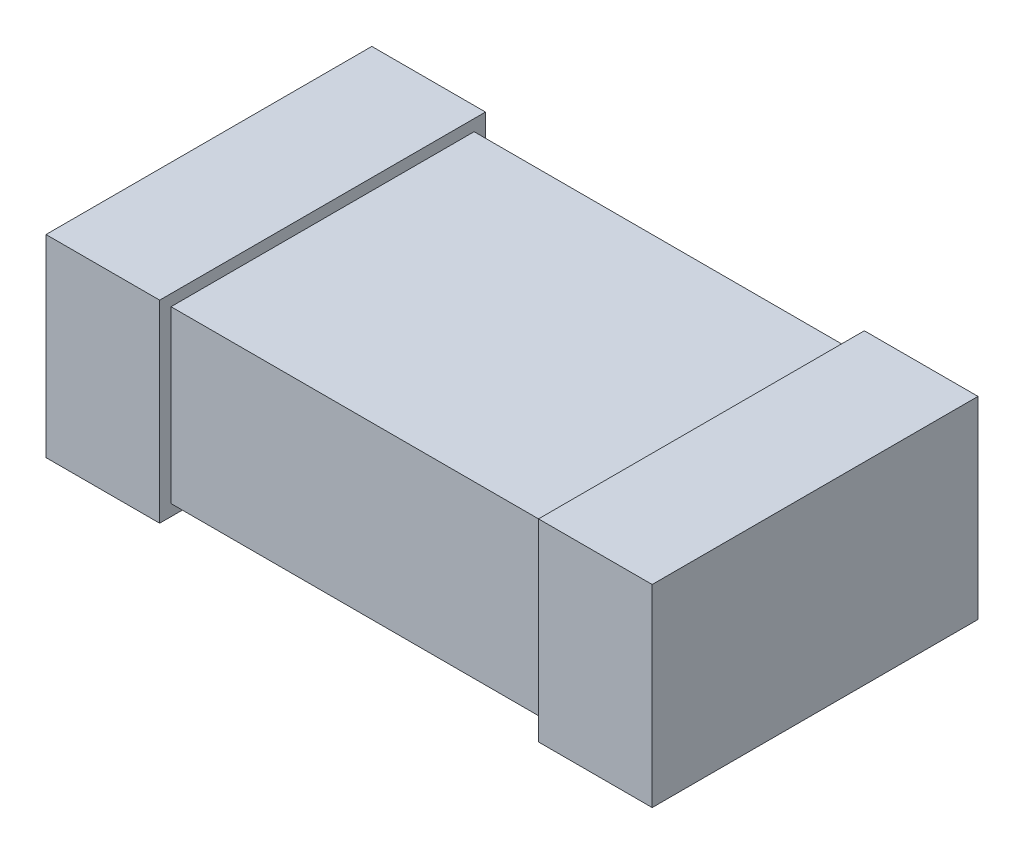
ISO-10303-21;
HEADER;
FILE_DESCRIPTION(('STEP AP214'),'2;1');
FILE_NAME('part.step','',(''),(''),'','','');
FILE_SCHEMA(('AUTOMOTIVE_DESIGN { 1 0 10303 214 1 1 1 1 }'));
ENDSEC;
DATA;
#1=APPLICATION_CONTEXT('core data for automotive mechanical design processes');
#2=APPLICATION_PROTOCOL_DEFINITION('international standard','automotive_design',2000,#1);
#3=PRODUCT_CONTEXT('',#1,'mechanical');
#4=PRODUCT('Part','Part','',(#3));
#5=PRODUCT_RELATED_PRODUCT_CATEGORY('part','',(#4));
#6=PRODUCT_DEFINITION_FORMATION('','',#4);
#7=PRODUCT_DEFINITION_CONTEXT('part definition',#1,'design');
#8=PRODUCT_DEFINITION('design','',#6,#7);
#9=PRODUCT_DEFINITION_SHAPE('','',#8);
#10=(LENGTH_UNIT() NAMED_UNIT(*) SI_UNIT(.MILLI.,.METRE.));
#11=(NAMED_UNIT(*) PLANE_ANGLE_UNIT() SI_UNIT($,.RADIAN.));
#12=(NAMED_UNIT(*) SI_UNIT($,.STERADIAN.) SOLID_ANGLE_UNIT());
#13=UNCERTAINTY_MEASURE_WITH_UNIT(LENGTH_MEASURE(1.E-05),#10,'distance_accuracy_value','');
#14=(GEOMETRIC_REPRESENTATION_CONTEXT(3) GLOBAL_UNCERTAINTY_ASSIGNED_CONTEXT((#13)) GLOBAL_UNIT_ASSIGNED_CONTEXT((#10,
#11,#12)) REPRESENTATION_CONTEXT('',''));
#15=CARTESIAN_POINT('',(0.,0.,0.));
#16=DIRECTION('',(0.,0.,1.));
#17=DIRECTION('',(1.,0.,0.));
#18=AXIS2_PLACEMENT_3D('',#15,#16,#17);
#19=CARTESIAN_POINT('',(-0.8,0.45,0.4));
#20=DIRECTION('',(0.,0.,-1.));
#21=DIRECTION('',(-1.,0.,0.));
#22=AXIS2_PLACEMENT_3D('',#19,#20,#21);
#23=PLANE('',#22);
#24=DIRECTION('',(0.,-1.,0.));
#25=VECTOR('',#24,1.);
#26=CARTESIAN_POINT('',(0.5,0.450000000000001,0.4));
#27=LINE('',#26,#25);
#28=CARTESIAN_POINT('',(0.5,0.45,0.4));
#29=VERTEX_POINT('',#28);
#30=CARTESIAN_POINT('',(0.5,0.,0.4));
#31=VERTEX_POINT('',#30);
#32=EDGE_CURVE('E51',#29,#31,#27,.T.);
#33=ORIENTED_EDGE('',*,*,#32,.F.);
#34=DIRECTION('',(1.,0.,0.));
#35=VECTOR('',#34,1.);
#36=CARTESIAN_POINT('',(-0.8,0.45,0.4));
#37=LINE('',#36,#35);
#38=CARTESIAN_POINT('',(-0.5,0.45,0.4));
#39=VERTEX_POINT('',#38);
#40=EDGE_CURVE('E216',#39,#29,#37,.T.);
#41=ORIENTED_EDGE('',*,*,#40,.F.);
#42=DIRECTION('',(0.,1.,0.));
#43=VECTOR('',#42,1.);
#44=CARTESIAN_POINT('',(-0.5,0.45,0.4));
#45=LINE('',#44,#43);
#46=CARTESIAN_POINT('',(-0.5,0.,0.4));
#47=VERTEX_POINT('',#46);
#48=EDGE_CURVE('E210',#47,#39,#45,.T.);
#49=ORIENTED_EDGE('',*,*,#48,.F.);
#50=DIRECTION('',(1.,0.,0.));
#51=VECTOR('',#50,1.);
#52=CARTESIAN_POINT('',(-0.8,0.,0.4));
#53=LINE('',#52,#51);
#54=EDGE_CURVE('E215',#47,#31,#53,.T.);
#55=ORIENTED_EDGE('',*,*,#54,.T.);
#56=EDGE_LOOP('',(#33,#41,#49,#55));
#57=FACE_BOUND('',#56,.T.);
#58=ADVANCED_FACE('F36',(#57),#23,.F.);
#59=CARTESIAN_POINT('',(-0.8,0.45,-0.4));
#60=DIRECTION('',(0.,0.,1.));
#61=DIRECTION('',(1.,0.,0.));
#62=AXIS2_PLACEMENT_3D('',#59,#60,#61);
#63=PLANE('',#62);
#64=DIRECTION('',(0.,1.,0.));
#65=VECTOR('',#64,1.);
#66=CARTESIAN_POINT('',(0.5,0.450000000000001,-0.4));
#67=LINE('',#66,#65);
#68=CARTESIAN_POINT('',(0.5,0.,-0.4));
#69=VERTEX_POINT('',#68);
#70=CARTESIAN_POINT('',(0.5,0.45,-0.4));
#71=VERTEX_POINT('',#70);
#72=EDGE_CURVE('E165',#69,#71,#67,.T.);
#73=ORIENTED_EDGE('',*,*,#72,.F.);
#74=DIRECTION('',(-1.,0.,0.));
#75=VECTOR('',#74,1.);
#76=CARTESIAN_POINT('',(-0.8,0.,-0.4));
#77=LINE('',#76,#75);
#78=CARTESIAN_POINT('',(-0.5,0.,-0.4));
#79=VERTEX_POINT('',#78);
#80=EDGE_CURVE('E219',#69,#79,#77,.T.);
#81=ORIENTED_EDGE('',*,*,#80,.T.);
#82=DIRECTION('',(0.,-1.,0.));
#83=VECTOR('',#82,1.);
#84=CARTESIAN_POINT('',(-0.5,0.45,-0.4));
#85=LINE('',#84,#83);
#86=CARTESIAN_POINT('',(-0.5,0.45,-0.4));
#87=VERTEX_POINT('',#86);
#88=EDGE_CURVE('E198',#87,#79,#85,.T.);
#89=ORIENTED_EDGE('',*,*,#88,.F.);
#90=DIRECTION('',(-1.,0.,0.));
#91=VECTOR('',#90,1.);
#92=CARTESIAN_POINT('',(-0.8,0.45,-0.4));
#93=LINE('',#92,#91);
#94=EDGE_CURVE('E218',#71,#87,#93,.T.);
#95=ORIENTED_EDGE('',*,*,#94,.F.);
#96=EDGE_LOOP('',(#73,#81,#89,#95));
#97=FACE_BOUND('',#96,.T.);
#98=ADVANCED_FACE('F236',(#97),#63,.F.);
#99=CARTESIAN_POINT('',(-0.8,0.45,0.4));
#100=DIRECTION('',(0.,1.,0.));
#101=DIRECTION('',(0.,0.,1.));
#102=AXIS2_PLACEMENT_3D('',#99,#100,#101);
#103=PLANE('',#102);
#104=ORIENTED_EDGE('',*,*,#40,.T.);
#105=DIRECTION('',(0.,0.,-1.));
#106=VECTOR('',#105,1.);
#107=CARTESIAN_POINT('',(0.5,0.45,0.4));
#108=LINE('',#107,#106);
#109=EDGE_CURVE('E58',#29,#71,#108,.T.);
#110=ORIENTED_EDGE('',*,*,#109,.T.);
#111=ORIENTED_EDGE('',*,*,#94,.T.);
#112=DIRECTION('',(0.,0.,1.));
#113=VECTOR('',#112,1.);
#114=CARTESIAN_POINT('',(-0.5,0.45,0.4));
#115=LINE('',#114,#113);
#116=EDGE_CURVE('E213',#87,#39,#115,.T.);
#117=ORIENTED_EDGE('',*,*,#116,.T.);
#118=EDGE_LOOP('',(#104,#110,#111,#117));
#119=FACE_BOUND('',#118,.T.);
#120=ADVANCED_FACE('F233',(#119),#103,.T.);
#121=CARTESIAN_POINT('',(-0.8,0.,0.4));
#122=DIRECTION('',(0.,1.,0.));
#123=DIRECTION('',(0.,0.,1.));
#124=AXIS2_PLACEMENT_3D('',#121,#122,#123);
#125=PLANE('',#124);
#126=DIRECTION('',(0.,0.,-1.));
#127=VECTOR('',#126,1.);
#128=CARTESIAN_POINT('',(0.5,0.,0.4));
#129=LINE('',#128,#127);
#130=EDGE_CURVE('E12',#31,#69,#129,.T.);
#131=ORIENTED_EDGE('',*,*,#130,.F.);
#132=ORIENTED_EDGE('',*,*,#54,.F.);
#133=DIRECTION('',(0.,0.,1.));
#134=VECTOR('',#133,1.);
#135=CARTESIAN_POINT('',(-0.5,0.,0.4));
#136=LINE('',#135,#134);
#137=EDGE_CURVE('E44',#79,#47,#136,.T.);
#138=ORIENTED_EDGE('',*,*,#137,.F.);
#139=ORIENTED_EDGE('',*,*,#80,.F.);
#140=EDGE_LOOP('',(#131,#132,#138,#139));
#141=FACE_BOUND('',#140,.T.);
#142=ADVANCED_FACE('F231',(#141),#125,.F.);
#143=CARTESIAN_POINT('',(-0.5,-0.03,1.05169248769948));
#144=DIRECTION('',(0.,1.,0.));
#145=DIRECTION('',(-1.,0.,0.));
#146=AXIS2_PLACEMENT_3D('',#143,#144,#145);
#147=PLANE('',#146);
#148=DIRECTION('',(0.,0.,-1.));
#149=VECTOR('',#148,1.);
#150=CARTESIAN_POINT('',(-0.5,-0.03,1.05169248769948));
#151=LINE('',#150,#149);
#152=CARTESIAN_POINT('',(-0.5,-0.03,0.43));
#153=VERTEX_POINT('',#152);
#154=CARTESIAN_POINT('',(-0.5,-0.03,-0.43));
#155=VERTEX_POINT('',#154);
#156=EDGE_CURVE('E187',#153,#155,#151,.T.);
#157=ORIENTED_EDGE('',*,*,#156,.F.);
#158=DIRECTION('',(-1.,0.,0.));
#159=VECTOR('',#158,1.);
#160=CARTESIAN_POINT('',(-0.5,-0.03,0.43));
#161=LINE('',#160,#159);
#162=CARTESIAN_POINT('',(-0.8,-0.03,0.43));
#163=VERTEX_POINT('',#162);
#164=EDGE_CURVE('E192',#153,#163,#161,.T.);
#165=ORIENTED_EDGE('',*,*,#164,.T.);
#166=DIRECTION('',(0.,0.,-1.));
#167=VECTOR('',#166,1.);
#168=CARTESIAN_POINT('',(-0.8,-0.03,1.05169248769948));
#169=LINE('',#168,#167);
#170=CARTESIAN_POINT('',(-0.8,-0.03,-0.43));
#171=VERTEX_POINT('',#170);
#172=EDGE_CURVE('E200',#163,#171,#169,.T.);
#173=ORIENTED_EDGE('',*,*,#172,.T.);
#174=DIRECTION('',(-1.,0.,0.));
#175=VECTOR('',#174,1.);
#176=CARTESIAN_POINT('',(-0.5,-0.03,-0.43));
#177=LINE('',#176,#175);
#178=EDGE_CURVE('E178',#155,#171,#177,.T.);
#179=ORIENTED_EDGE('',*,*,#178,.F.);
#180=EDGE_LOOP('',(#157,#165,#173,#179));
#181=FACE_BOUND('',#180,.T.);
#182=ADVANCED_FACE('F277',(#181),#147,.F.);
#183=CARTESIAN_POINT('',(-0.5,0.48,1.05169248769948));
#184=DIRECTION('',(0.,-1.,0.));
#185=DIRECTION('',(0.,0.,-1.));
#186=AXIS2_PLACEMENT_3D('',#183,#184,#185);
#187=PLANE('',#186);
#188=DIRECTION('',(0.,0.,-1.));
#189=VECTOR('',#188,1.);
#190=CARTESIAN_POINT('',(-0.8,0.48,1.05169248769948));
#191=LINE('',#190,#189);
#192=CARTESIAN_POINT('',(-0.8,0.48,0.43));
#193=VERTEX_POINT('',#192);
#194=CARTESIAN_POINT('',(-0.8,0.48,-0.43));
#195=VERTEX_POINT('',#194);
#196=EDGE_CURVE('E202',#193,#195,#191,.T.);
#197=ORIENTED_EDGE('',*,*,#196,.F.);
#198=DIRECTION('',(1.,0.,0.));
#199=VECTOR('',#198,1.);
#200=CARTESIAN_POINT('',(-0.5,0.48,0.43));
#201=LINE('',#200,#199);
#202=CARTESIAN_POINT('',(-0.5,0.48,0.43));
#203=VERTEX_POINT('',#202);
#204=EDGE_CURVE('E191',#193,#203,#201,.T.);
#205=ORIENTED_EDGE('',*,*,#204,.T.);
#206=DIRECTION('',(0.,0.,-1.));
#207=VECTOR('',#206,1.);
#208=CARTESIAN_POINT('',(-0.5,0.48,1.05169248769948));
#209=LINE('',#208,#207);
#210=CARTESIAN_POINT('',(-0.5,0.48,-0.43));
#211=VERTEX_POINT('',#210);
#212=EDGE_CURVE('E204',#203,#211,#209,.T.);
#213=ORIENTED_EDGE('',*,*,#212,.T.);
#214=DIRECTION('',(1.,0.,0.));
#215=VECTOR('',#214,1.);
#216=CARTESIAN_POINT('',(-0.5,0.48,-0.43));
#217=LINE('',#216,#215);
#218=EDGE_CURVE('E184',#195,#211,#217,.T.);
#219=ORIENTED_EDGE('',*,*,#218,.F.);
#220=EDGE_LOOP('',(#197,#205,#213,#219));
#221=FACE_BOUND('',#220,.T.);
#222=ADVANCED_FACE('F280',(#221),#187,.F.);
#223=CARTESIAN_POINT('',(-0.5,0.48,1.05169248769948));
#224=DIRECTION('',(-1.,0.,0.));
#225=DIRECTION('',(0.,0.,1.));
#226=AXIS2_PLACEMENT_3D('',#223,#224,#225);
#227=PLANE('',#226);
#228=ORIENTED_EDGE('',*,*,#116,.F.);
#229=ORIENTED_EDGE('',*,*,#88,.T.);
#230=ORIENTED_EDGE('',*,*,#137,.T.);
#231=ORIENTED_EDGE('',*,*,#48,.T.);
#232=EDGE_LOOP('',(#228,#229,#230,#231));
#233=FACE_BOUND('',#232,.T.);
#234=ORIENTED_EDGE('',*,*,#212,.F.);
#235=DIRECTION('',(0.,-1.,0.));
#236=VECTOR('',#235,1.);
#237=CARTESIAN_POINT('',(-0.5,0.48,0.43));
#238=LINE('',#237,#236);
#239=EDGE_CURVE('E195',#203,#153,#238,.T.);
#240=ORIENTED_EDGE('',*,*,#239,.T.);
#241=ORIENTED_EDGE('',*,*,#156,.T.);
#242=DIRECTION('',(0.,-1.,0.));
#243=VECTOR('',#242,1.);
#244=CARTESIAN_POINT('',(-0.5,0.48,-0.43));
#245=LINE('',#244,#243);
#246=EDGE_CURVE('E181',#211,#155,#245,.T.);
#247=ORIENTED_EDGE('',*,*,#246,.F.);
#248=EDGE_LOOP('',(#234,#240,#241,#247));
#249=FACE_BOUND('',#248,.T.);
#250=ADVANCED_FACE('F226',(#233,#249),#227,.F.);
#251=CARTESIAN_POINT('',(-0.8,0.45,0.43));
#252=DIRECTION('',(0.,0.,-1.));
#253=DIRECTION('',(-1.,0.,0.));
#254=AXIS2_PLACEMENT_3D('',#251,#252,#253);
#255=PLANE('',#254);
#256=ORIENTED_EDGE('',*,*,#204,.F.);
#257=DIRECTION('',(0.,1.,0.));
#258=VECTOR('',#257,1.);
#259=CARTESIAN_POINT('',(-0.8,0.48,0.43));
#260=LINE('',#259,#258);
#261=EDGE_CURVE('E188',#163,#193,#260,.T.);
#262=ORIENTED_EDGE('',*,*,#261,.F.);
#263=ORIENTED_EDGE('',*,*,#164,.F.);
#264=ORIENTED_EDGE('',*,*,#239,.F.);
#265=EDGE_LOOP('',(#256,#262,#263,#264));
#266=FACE_BOUND('',#265,.T.);
#267=ADVANCED_FACE('F272',(#266),#255,.F.);
#268=CARTESIAN_POINT('',(-0.8,0.45,-0.43));
#269=DIRECTION('',(0.,0.,1.));
#270=DIRECTION('',(1.,0.,0.));
#271=AXIS2_PLACEMENT_3D('',#268,#269,#270);
#272=PLANE('',#271);
#273=ORIENTED_EDGE('',*,*,#246,.T.);
#274=ORIENTED_EDGE('',*,*,#178,.T.);
#275=DIRECTION('',(0.,1.,0.));
#276=VECTOR('',#275,1.);
#277=CARTESIAN_POINT('',(-0.8,0.48,-0.43));
#278=LINE('',#277,#276);
#279=EDGE_CURVE('E175',#171,#195,#278,.T.);
#280=ORIENTED_EDGE('',*,*,#279,.T.);
#281=ORIENTED_EDGE('',*,*,#218,.T.);
#282=EDGE_LOOP('',(#273,#274,#280,#281));
#283=FACE_BOUND('',#282,.T.);
#284=ADVANCED_FACE('F269',(#283),#272,.F.);
#285=CARTESIAN_POINT('',(-0.8,0.45,-0.4));
#286=DIRECTION('',(1.,0.,0.));
#287=DIRECTION('',(0.,0.,-1.));
#288=AXIS2_PLACEMENT_3D('',#285,#286,#287);
#289=PLANE('',#288);
#290=ORIENTED_EDGE('',*,*,#172,.F.);
#291=ORIENTED_EDGE('',*,*,#261,.T.);
#292=ORIENTED_EDGE('',*,*,#196,.T.);
#293=ORIENTED_EDGE('',*,*,#279,.F.);
#294=EDGE_LOOP('',(#290,#291,#292,#293));
#295=FACE_BOUND('',#294,.T.);
#296=ADVANCED_FACE('F38',(#295),#289,.F.);
#297=CARTESIAN_POINT('',(0.5,-0.0299999999999999,1.05169248769948));
#298=DIRECTION('',(0.,1.,0.));
#299=DIRECTION('',(-1.,0.,0.));
#300=AXIS2_PLACEMENT_3D('',#297,#298,#299);
#301=PLANE('',#300);
#302=DIRECTION('',(0.,0.,-1.));
#303=VECTOR('',#302,1.);
#304=CARTESIAN_POINT('',(0.8,-0.0299999999999998,1.05169248769948));
#305=LINE('',#304,#303);
#306=CARTESIAN_POINT('',(0.8,-0.0299999999999998,0.43));
#307=VERTEX_POINT('',#306);
#308=CARTESIAN_POINT('',(0.8,-0.0299999999999998,-0.43));
#309=VERTEX_POINT('',#308);
#310=EDGE_CURVE('E138',#307,#309,#305,.T.);
#311=ORIENTED_EDGE('',*,*,#310,.F.);
#312=DIRECTION('',(-1.,0.,0.));
#313=VECTOR('',#312,1.);
#314=CARTESIAN_POINT('',(0.5,-0.0299999999999999,0.43));
#315=LINE('',#314,#313);
#316=CARTESIAN_POINT('',(0.5,-0.0299999999999999,0.43));
#317=VERTEX_POINT('',#316);
#318=EDGE_CURVE('E133',#307,#317,#315,.T.);
#319=ORIENTED_EDGE('',*,*,#318,.T.);
#320=DIRECTION('',(0.,0.,-1.));
#321=VECTOR('',#320,1.);
#322=CARTESIAN_POINT('',(0.5,-0.0299999999999999,1.05169248769948));
#323=LINE('',#322,#321);
#324=CARTESIAN_POINT('',(0.5,-0.0299999999999999,-0.43));
#325=VERTEX_POINT('',#324);
#326=EDGE_CURVE('E128',#317,#325,#323,.T.);
#327=ORIENTED_EDGE('',*,*,#326,.T.);
#328=DIRECTION('',(-1.,0.,0.));
#329=VECTOR('',#328,1.);
#330=CARTESIAN_POINT('',(0.5,-0.0299999999999999,-0.43));
#331=LINE('',#330,#329);
#332=EDGE_CURVE('E132',#309,#325,#331,.T.);
#333=ORIENTED_EDGE('',*,*,#332,.F.);
#334=EDGE_LOOP('',(#311,#319,#327,#333));
#335=FACE_BOUND('',#334,.T.);
#336=ADVANCED_FACE('F131',(#335),#301,.F.);
#337=CARTESIAN_POINT('',(0.5,0.48,1.05169248769948));
#338=DIRECTION('',(1.,0.,0.));
#339=DIRECTION('',(0.,1.,0.));
#340=AXIS2_PLACEMENT_3D('',#337,#338,#339);
#341=PLANE('',#340);
#342=ORIENTED_EDGE('',*,*,#109,.F.);
#343=ORIENTED_EDGE('',*,*,#32,.T.);
#344=ORIENTED_EDGE('',*,*,#130,.T.);
#345=ORIENTED_EDGE('',*,*,#72,.T.);
#346=EDGE_LOOP('',(#342,#343,#344,#345));
#347=FACE_BOUND('',#346,.T.);
#348=ORIENTED_EDGE('',*,*,#326,.F.);
#349=DIRECTION('',(0.,1.,0.));
#350=VECTOR('',#349,1.);
#351=CARTESIAN_POINT('',(0.5,0.48,0.43));
#352=LINE('',#351,#350);
#353=CARTESIAN_POINT('',(0.5,0.48,0.43));
#354=VERTEX_POINT('',#353);
#355=EDGE_CURVE('E160',#317,#354,#352,.T.);
#356=ORIENTED_EDGE('',*,*,#355,.T.);
#357=DIRECTION('',(0.,0.,-1.));
#358=VECTOR('',#357,1.);
#359=CARTESIAN_POINT('',(0.5,0.48,1.05169248769948));
#360=LINE('',#359,#358);
#361=CARTESIAN_POINT('',(0.5,0.48,-0.43));
#362=VERTEX_POINT('',#361);
#363=EDGE_CURVE('E137',#354,#362,#360,.T.);
#364=ORIENTED_EDGE('',*,*,#363,.T.);
#365=DIRECTION('',(0.,1.,0.));
#366=VECTOR('',#365,1.);
#367=CARTESIAN_POINT('',(0.5,0.48,-0.43));
#368=LINE('',#367,#366);
#369=EDGE_CURVE('E145',#325,#362,#368,.T.);
#370=ORIENTED_EDGE('',*,*,#369,.F.);
#371=EDGE_LOOP('',(#348,#356,#364,#370));
#372=FACE_BOUND('',#371,.T.);
#373=ADVANCED_FACE('F150',(#347,#372),#341,.F.);
#374=CARTESIAN_POINT('',(0.5,0.48,1.05169248769948));
#375=DIRECTION('',(0.,-1.,0.));
#376=DIRECTION('',(1.,0.,0.));
#377=AXIS2_PLACEMENT_3D('',#374,#375,#376);
#378=PLANE('',#377);
#379=ORIENTED_EDGE('',*,*,#363,.F.);
#380=DIRECTION('',(1.,0.,0.));
#381=VECTOR('',#380,1.);
#382=CARTESIAN_POINT('',(0.5,0.48,0.43));
#383=LINE('',#382,#381);
#384=CARTESIAN_POINT('',(0.8,0.48,0.43));
#385=VERTEX_POINT('',#384);
#386=EDGE_CURVE('E163',#354,#385,#383,.T.);
#387=ORIENTED_EDGE('',*,*,#386,.T.);
#388=DIRECTION('',(0.,0.,-1.));
#389=VECTOR('',#388,1.);
#390=CARTESIAN_POINT('',(0.8,0.48,1.05169248769948));
#391=LINE('',#390,#389);
#392=CARTESIAN_POINT('',(0.8,0.48,-0.43));
#393=VERTEX_POINT('',#392);
#394=EDGE_CURVE('E152',#385,#393,#391,.T.);
#395=ORIENTED_EDGE('',*,*,#394,.T.);
#396=DIRECTION('',(1.,0.,0.));
#397=VECTOR('',#396,1.);
#398=CARTESIAN_POINT('',(0.5,0.48,-0.43));
#399=LINE('',#398,#397);
#400=EDGE_CURVE('E153',#362,#393,#399,.T.);
#401=ORIENTED_EDGE('',*,*,#400,.F.);
#402=EDGE_LOOP('',(#379,#387,#395,#401));
#403=FACE_BOUND('',#402,.T.);
#404=ADVANCED_FACE('F256',(#403),#378,.F.);
#405=CARTESIAN_POINT('',(-0.8,0.45,0.43));
#406=DIRECTION('',(0.,0.,-1.));
#407=DIRECTION('',(-1.,0.,0.));
#408=AXIS2_PLACEMENT_3D('',#405,#406,#407);
#409=PLANE('',#408);
#410=ORIENTED_EDGE('',*,*,#355,.F.);
#411=ORIENTED_EDGE('',*,*,#318,.F.);
#412=DIRECTION('',(0.,-1.,0.));
#413=VECTOR('',#412,1.);
#414=CARTESIAN_POINT('',(0.8,0.48,0.43));
#415=LINE('',#414,#413);
#416=EDGE_CURVE('E161',#385,#307,#415,.T.);
#417=ORIENTED_EDGE('',*,*,#416,.F.);
#418=ORIENTED_EDGE('',*,*,#386,.F.);
#419=EDGE_LOOP('',(#410,#411,#417,#418));
#420=FACE_BOUND('',#419,.T.);
#421=ADVANCED_FACE('F252',(#420),#409,.F.);
#422=CARTESIAN_POINT('',(-0.8,0.45,-0.43));
#423=DIRECTION('',(0.,0.,1.));
#424=DIRECTION('',(1.,0.,0.));
#425=AXIS2_PLACEMENT_3D('',#422,#423,#424);
#426=PLANE('',#425);
#427=ORIENTED_EDGE('',*,*,#400,.T.);
#428=DIRECTION('',(0.,-1.,0.));
#429=VECTOR('',#428,1.);
#430=CARTESIAN_POINT('',(0.8,0.48,-0.43));
#431=LINE('',#430,#429);
#432=EDGE_CURVE('E148',#393,#309,#431,.T.);
#433=ORIENTED_EDGE('',*,*,#432,.T.);
#434=ORIENTED_EDGE('',*,*,#332,.T.);
#435=ORIENTED_EDGE('',*,*,#369,.T.);
#436=EDGE_LOOP('',(#427,#433,#434,#435));
#437=FACE_BOUND('',#436,.T.);
#438=ADVANCED_FACE('F144',(#437),#426,.F.);
#439=CARTESIAN_POINT('',(0.8,0.45,-0.4));
#440=DIRECTION('',(-1.,0.,0.));
#441=DIRECTION('',(0.,0.,1.));
#442=AXIS2_PLACEMENT_3D('',#439,#440,#441);
#443=PLANE('',#442);
#444=ORIENTED_EDGE('',*,*,#394,.F.);
#445=ORIENTED_EDGE('',*,*,#416,.T.);
#446=ORIENTED_EDGE('',*,*,#310,.T.);
#447=ORIENTED_EDGE('',*,*,#432,.F.);
#448=EDGE_LOOP('',(#444,#445,#446,#447));
#449=FACE_BOUND('',#448,.T.);
#450=ADVANCED_FACE('F246',(#449),#443,.F.);
#451=CLOSED_SHELL('',(#58,#98,#120,#142,#182,#222,#250,#267,#284,#296,#336,#373,#404,#421,#438,#450));
#452=MANIFOLD_SOLID_BREP('B2',#451);
#453=ADVANCED_BREP_SHAPE_REPRESENTATION('',(#18,#452),#14);
#454=SHAPE_DEFINITION_REPRESENTATION(#9,#453);
ENDSEC;
END-ISO-10303-21;
